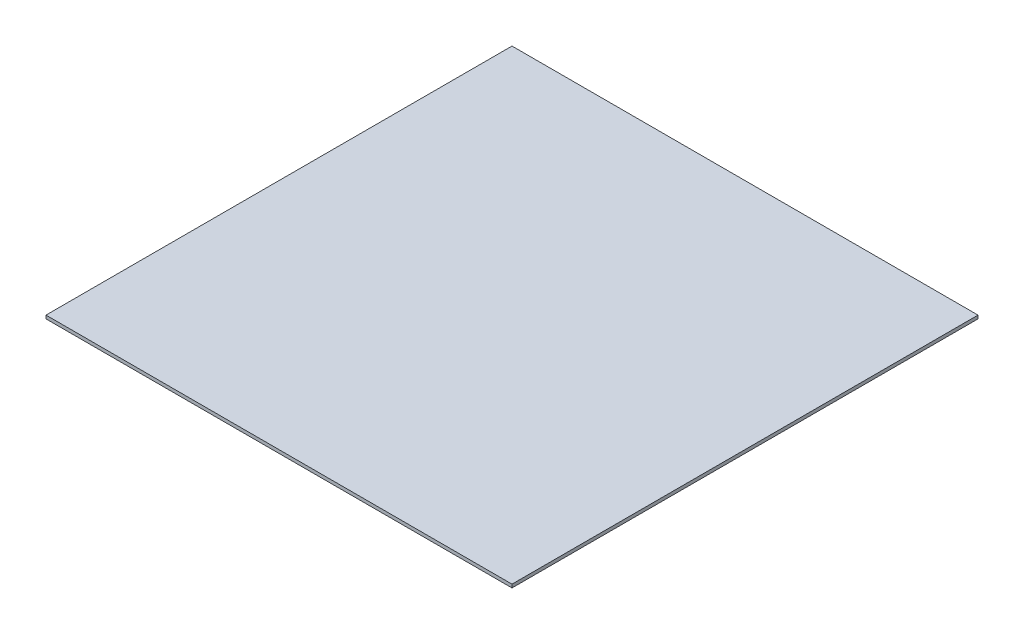
ISO-10303-21;
HEADER;
FILE_DESCRIPTION(('STEP AP214'),'2;1');
FILE_NAME('part.step','',(''),(''),'','','');
FILE_SCHEMA(('AUTOMOTIVE_DESIGN { 1 0 10303 214 1 1 1 1 }'));
ENDSEC;
DATA;
#1=APPLICATION_CONTEXT('core data for automotive mechanical design processes');
#2=APPLICATION_PROTOCOL_DEFINITION('international standard','automotive_design',2000,#1);
#3=PRODUCT_CONTEXT('',#1,'mechanical');
#4=PRODUCT('Part','Part','',(#3));
#5=PRODUCT_RELATED_PRODUCT_CATEGORY('part','',(#4));
#6=PRODUCT_DEFINITION_FORMATION('','',#4);
#7=PRODUCT_DEFINITION_CONTEXT('part definition',#1,'design');
#8=PRODUCT_DEFINITION('design','',#6,#7);
#9=PRODUCT_DEFINITION_SHAPE('','',#8);
#10=(LENGTH_UNIT() NAMED_UNIT(*) SI_UNIT(.MILLI.,.METRE.));
#11=(NAMED_UNIT(*) PLANE_ANGLE_UNIT() SI_UNIT($,.RADIAN.));
#12=(NAMED_UNIT(*) SI_UNIT($,.STERADIAN.) SOLID_ANGLE_UNIT());
#13=UNCERTAINTY_MEASURE_WITH_UNIT(LENGTH_MEASURE(1.E-05),#10,'distance_accuracy_value','');
#14=(GEOMETRIC_REPRESENTATION_CONTEXT(3) GLOBAL_UNCERTAINTY_ASSIGNED_CONTEXT((#13)) GLOBAL_UNIT_ASSIGNED_CONTEXT((#10,
#11,#12)) REPRESENTATION_CONTEXT('',''));
#15=CARTESIAN_POINT('',(0.,0.,0.));
#16=DIRECTION('',(0.,0.,1.));
#17=DIRECTION('',(1.,0.,0.));
#18=AXIS2_PLACEMENT_3D('',#15,#16,#17);
#19=CARTESIAN_POINT('',(13.38375,0.66675,-13.38375));
#20=DIRECTION('',(1.,0.,0.));
#21=DIRECTION('',(0.,0.,-1.));
#22=AXIS2_PLACEMENT_3D('',#19,#20,#21);
#23=PLANE('',#22);
#24=DIRECTION('',(0.,0.,1.));
#25=VECTOR('',#24,1.);
#26=CARTESIAN_POINT('',(13.38375,0.09525,-13.38375));
#27=LINE('',#26,#25);
#28=CARTESIAN_POINT('',(13.38375,0.09525,-93.6862499999998));
#29=VERTEX_POINT('',#28);
#30=CARTESIAN_POINT('',(13.38375,0.09525,-13.38375));
#31=VERTEX_POINT('',#30);
#32=EDGE_CURVE('E98',#29,#31,#27,.T.);
#33=ORIENTED_EDGE('',*,*,#32,.T.);
#34=DIRECTION('',(0.,-1.,0.));
#35=VECTOR('',#34,1.);
#36=CARTESIAN_POINT('',(13.38375,0.66675,-13.38375));
#37=LINE('',#36,#35);
#38=CARTESIAN_POINT('',(13.38375,0.66675,-13.38375));
#39=VERTEX_POINT('',#38);
#40=EDGE_CURVE('E11',#39,#31,#37,.T.);
#41=ORIENTED_EDGE('',*,*,#40,.F.);
#42=DIRECTION('',(0.,0.,1.));
#43=VECTOR('',#42,1.);
#44=CARTESIAN_POINT('',(13.38375,0.66675,-13.38375));
#45=LINE('',#44,#43);
#46=CARTESIAN_POINT('',(13.38375,0.66675,-93.6862499999998));
#47=VERTEX_POINT('',#46);
#48=EDGE_CURVE('E86',#47,#39,#45,.T.);
#49=ORIENTED_EDGE('',*,*,#48,.F.);
#50=DIRECTION('',(0.,-1.,0.));
#51=VECTOR('',#50,1.);
#52=CARTESIAN_POINT('',(13.38375,0.66675,-93.6862499999998));
#53=LINE('',#52,#51);
#54=EDGE_CURVE('E94',#47,#29,#53,.T.);
#55=ORIENTED_EDGE('',*,*,#54,.T.);
#56=EDGE_LOOP('',(#33,#41,#49,#55));
#57=FACE_BOUND('',#56,.T.);
#58=ADVANCED_FACE('F35',(#57),#23,.F.);
#59=CARTESIAN_POINT('',(13.38375,0.66675,-13.38375));
#60=DIRECTION('',(0.,0.,-1.));
#61=DIRECTION('',(-1.,0.,0.));
#62=AXIS2_PLACEMENT_3D('',#59,#60,#61);
#63=PLANE('',#62);
#64=DIRECTION('',(1.,0.,0.));
#65=VECTOR('',#64,1.);
#66=CARTESIAN_POINT('',(13.38375,0.09525,-13.38375));
#67=LINE('',#66,#65);
#68=CARTESIAN_POINT('',(93.6862500000002,0.09525,-13.38375));
#69=VERTEX_POINT('',#68);
#70=EDGE_CURVE('E90',#31,#69,#67,.T.);
#71=ORIENTED_EDGE('',*,*,#70,.T.);
#72=DIRECTION('',(0.,-1.,0.));
#73=VECTOR('',#72,1.);
#74=CARTESIAN_POINT('',(93.6862500000002,0.66675,-13.38375));
#75=LINE('',#74,#73);
#76=CARTESIAN_POINT('',(93.6862500000002,0.66675,-13.38375));
#77=VERTEX_POINT('',#76);
#78=EDGE_CURVE('E43',#77,#69,#75,.T.);
#79=ORIENTED_EDGE('',*,*,#78,.F.);
#80=DIRECTION('',(1.,0.,0.));
#81=VECTOR('',#80,1.);
#82=CARTESIAN_POINT('',(13.38375,0.66675,-13.38375));
#83=LINE('',#82,#81);
#84=EDGE_CURVE('E81',#39,#77,#83,.T.);
#85=ORIENTED_EDGE('',*,*,#84,.F.);
#86=ORIENTED_EDGE('',*,*,#40,.T.);
#87=EDGE_LOOP('',(#71,#79,#85,#86));
#88=FACE_BOUND('',#87,.T.);
#89=ADVANCED_FACE('F89',(#88),#63,.F.);
#90=CARTESIAN_POINT('',(93.6862500000002,0.66675,-93.6862499999998));
#91=DIRECTION('',(-1.,0.,0.));
#92=DIRECTION('',(0.,0.,1.));
#93=AXIS2_PLACEMENT_3D('',#90,#91,#92);
#94=PLANE('',#93);
#95=DIRECTION('',(0.,0.,-1.));
#96=VECTOR('',#95,1.);
#97=CARTESIAN_POINT('',(93.6862500000002,0.09525,-93.6862499999998));
#98=LINE('',#97,#96);
#99=CARTESIAN_POINT('',(93.6862500000002,0.09525,-93.6862499999998));
#100=VERTEX_POINT('',#99);
#101=EDGE_CURVE('E68',#69,#100,#98,.T.);
#102=ORIENTED_EDGE('',*,*,#101,.T.);
#103=DIRECTION('',(0.,-1.,0.));
#104=VECTOR('',#103,1.);
#105=CARTESIAN_POINT('',(93.6862500000002,0.66675,-93.6862499999998));
#106=LINE('',#105,#104);
#107=CARTESIAN_POINT('',(93.6862500000002,0.66675,-93.6862499999998));
#108=VERTEX_POINT('',#107);
#109=EDGE_CURVE('E91',#108,#100,#106,.T.);
#110=ORIENTED_EDGE('',*,*,#109,.F.);
#111=DIRECTION('',(0.,0.,-1.));
#112=VECTOR('',#111,1.);
#113=CARTESIAN_POINT('',(93.6862500000002,0.66675,-93.6862499999998));
#114=LINE('',#113,#112);
#115=EDGE_CURVE('E84',#77,#108,#114,.T.);
#116=ORIENTED_EDGE('',*,*,#115,.F.);
#117=ORIENTED_EDGE('',*,*,#78,.T.);
#118=EDGE_LOOP('',(#102,#110,#116,#117));
#119=FACE_BOUND('',#118,.T.);
#120=ADVANCED_FACE('F92',(#119),#94,.F.);
#121=CARTESIAN_POINT('',(13.38375,0.66675,-93.6862499999998));
#122=DIRECTION('',(0.,0.,1.));
#123=DIRECTION('',(1.,0.,0.));
#124=AXIS2_PLACEMENT_3D('',#121,#122,#123);
#125=PLANE('',#124);
#126=DIRECTION('',(-1.,0.,0.));
#127=VECTOR('',#126,1.);
#128=CARTESIAN_POINT('',(13.38375,0.09525,-93.6862499999998));
#129=LINE('',#128,#127);
#130=EDGE_CURVE('E74',#100,#29,#129,.T.);
#131=ORIENTED_EDGE('',*,*,#130,.T.);
#132=ORIENTED_EDGE('',*,*,#54,.F.);
#133=DIRECTION('',(-1.,0.,0.));
#134=VECTOR('',#133,1.);
#135=CARTESIAN_POINT('',(13.38375,0.66675,-93.6862499999998));
#136=LINE('',#135,#134);
#137=EDGE_CURVE('E51',#108,#47,#136,.T.);
#138=ORIENTED_EDGE('',*,*,#137,.F.);
#139=ORIENTED_EDGE('',*,*,#109,.T.);
#140=EDGE_LOOP('',(#131,#132,#138,#139));
#141=FACE_BOUND('',#140,.T.);
#142=ADVANCED_FACE('F105',(#141),#125,.F.);
#143=CARTESIAN_POINT('',(13.38375,0.66675,-13.38375));
#144=DIRECTION('',(0.,-1.,0.));
#145=DIRECTION('',(0.,0.,-1.));
#146=AXIS2_PLACEMENT_3D('',#143,#144,#145);
#147=PLANE('',#146);
#148=ORIENTED_EDGE('',*,*,#48,.T.);
#149=ORIENTED_EDGE('',*,*,#84,.T.);
#150=ORIENTED_EDGE('',*,*,#115,.T.);
#151=ORIENTED_EDGE('',*,*,#137,.T.);
#152=EDGE_LOOP('',(#148,#149,#150,#151));
#153=FACE_BOUND('',#152,.T.);
#154=ADVANCED_FACE('F82',(#153),#147,.F.);
#155=CARTESIAN_POINT('',(13.38375,0.09525,-13.38375));
#156=DIRECTION('',(0.,-1.,0.));
#157=DIRECTION('',(0.,0.,-1.));
#158=AXIS2_PLACEMENT_3D('',#155,#156,#157);
#159=PLANE('',#158);
#160=ORIENTED_EDGE('',*,*,#32,.F.);
#161=ORIENTED_EDGE('',*,*,#130,.F.);
#162=ORIENTED_EDGE('',*,*,#101,.F.);
#163=ORIENTED_EDGE('',*,*,#70,.F.);
#164=EDGE_LOOP('',(#160,#161,#162,#163));
#165=FACE_BOUND('',#164,.T.);
#166=ADVANCED_FACE('F108',(#165),#159,.T.);
#167=CLOSED_SHELL('',(#58,#89,#120,#142,#154,#166));
#168=MANIFOLD_SOLID_BREP('B2',#167);
#169=ADVANCED_BREP_SHAPE_REPRESENTATION('',(#18,#168),#14);
#170=SHAPE_DEFINITION_REPRESENTATION(#9,#169);
ENDSEC;
END-ISO-10303-21;
